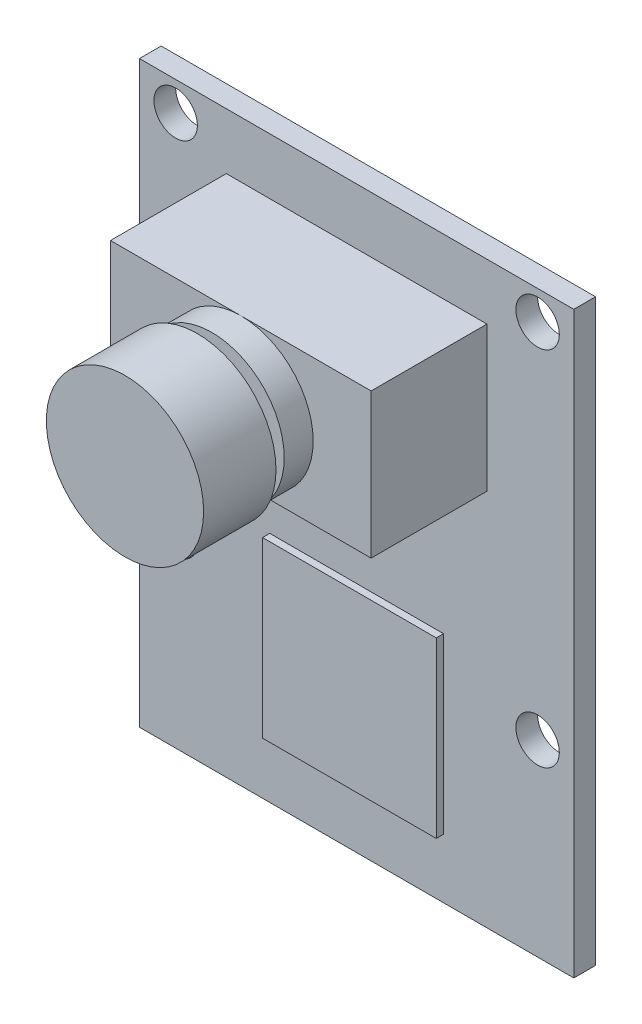
ISO-10303-21;
HEADER;
FILE_DESCRIPTION(('STEP AP214'),'2;1');
FILE_NAME('part.step','',(''),(''),'','','');
FILE_SCHEMA(('AUTOMOTIVE_DESIGN { 1 0 10303 214 1 1 1 1 }'));
ENDSEC;
DATA;
#1=APPLICATION_CONTEXT('core data for automotive mechanical design processes');
#2=APPLICATION_PROTOCOL_DEFINITION('international standard','automotive_design',2000,#1);
#3=PRODUCT_CONTEXT('',#1,'mechanical');
#4=PRODUCT('Part','Part','',(#3));
#5=PRODUCT_RELATED_PRODUCT_CATEGORY('part','',(#4));
#6=PRODUCT_DEFINITION_FORMATION('','',#4);
#7=PRODUCT_DEFINITION_CONTEXT('part definition',#1,'design');
#8=PRODUCT_DEFINITION('design','',#6,#7);
#9=PRODUCT_DEFINITION_SHAPE('','',#8);
#10=(LENGTH_UNIT() NAMED_UNIT(*) SI_UNIT(.MILLI.,.METRE.));
#11=(NAMED_UNIT(*) PLANE_ANGLE_UNIT() SI_UNIT($,.RADIAN.));
#12=(NAMED_UNIT(*) SI_UNIT($,.STERADIAN.) SOLID_ANGLE_UNIT());
#13=UNCERTAINTY_MEASURE_WITH_UNIT(LENGTH_MEASURE(1.E-05),#10,'distance_accuracy_value','');
#14=(GEOMETRIC_REPRESENTATION_CONTEXT(3) GLOBAL_UNCERTAINTY_ASSIGNED_CONTEXT((#13)) GLOBAL_UNIT_ASSIGNED_CONTEXT((#10,
#11,#12)) REPRESENTATION_CONTEXT('',''));
#15=CARTESIAN_POINT('',(0.,0.,0.));
#16=DIRECTION('',(0.,0.,1.));
#17=DIRECTION('',(1.,0.,0.));
#18=AXIS2_PLACEMENT_3D('',#15,#16,#17);
#19=CARTESIAN_POINT('',(0.,0.,1.5));
#20=DIRECTION('',(0.,0.,1.));
#21=DIRECTION('',(1.,0.,0.));
#22=AXIS2_PLACEMENT_3D('',#19,#20,#21);
#23=PLANE('',#22);
#24=CARTESIAN_POINT('',(12.5,-7.01054570839067,1.5));
#25=DIRECTION('',(0.,0.,1.));
#26=DIRECTION('',(1.,0.,0.));
#27=AXIS2_PLACEMENT_3D('',#24,#25,#26);
#28=CIRCLE('',#27,1.5);
#29=CARTESIAN_POINT('',(14.,-7.01054570839067,1.5));
#30=VERTEX_POINT('',#29);
#31=EDGE_CURVE('E235',#30,#30,#28,.T.);
#32=ORIENTED_EDGE('',*,*,#31,.F.);
#33=EDGE_LOOP('',(#32));
#34=FACE_BOUND('',#33,.T.);
#35=CARTESIAN_POINT('',(-12.5,-7.01054570839068,1.5));
#36=DIRECTION('',(0.,0.,1.));
#37=DIRECTION('',(1.,0.,0.));
#38=AXIS2_PLACEMENT_3D('',#35,#36,#37);
#39=CIRCLE('',#38,1.5);
#40=CARTESIAN_POINT('',(-11.,-7.01054570839068,1.5));
#41=VERTEX_POINT('',#40);
#42=EDGE_CURVE('E249',#41,#41,#39,.T.);
#43=ORIENTED_EDGE('',*,*,#42,.F.);
#44=EDGE_LOOP('',(#43));
#45=FACE_BOUND('',#44,.T.);
#46=CARTESIAN_POINT('',(-12.5,17.9894542916093,1.5));
#47=DIRECTION('',(0.,0.,1.));
#48=DIRECTION('',(1.,0.,0.));
#49=AXIS2_PLACEMENT_3D('',#46,#47,#48);
#50=CIRCLE('',#49,1.5);
#51=CARTESIAN_POINT('',(-11.,17.9894542916093,1.5));
#52=VERTEX_POINT('',#51);
#53=EDGE_CURVE('E241',#52,#52,#50,.T.);
#54=ORIENTED_EDGE('',*,*,#53,.F.);
#55=EDGE_LOOP('',(#54));
#56=FACE_BOUND('',#55,.T.);
#57=CARTESIAN_POINT('',(12.5,17.9894542916093,1.5));
#58=DIRECTION('',(0.,0.,1.));
#59=DIRECTION('',(1.,0.,0.));
#60=AXIS2_PLACEMENT_3D('',#57,#58,#59);
#61=CIRCLE('',#60,1.5);
#62=CARTESIAN_POINT('',(14.,17.9894542916093,1.5));
#63=VERTEX_POINT('',#62);
#64=EDGE_CURVE('E240',#63,#63,#61,.T.);
#65=ORIENTED_EDGE('',*,*,#64,.F.);
#66=EDGE_LOOP('',(#65));
#67=FACE_BOUND('',#66,.T.);
#68=DIRECTION('',(0.,-1.,0.));
#69=VECTOR('',#68,1.);
#70=CARTESIAN_POINT('',(-15.,-20.,1.5));
#71=LINE('',#70,#69);
#72=CARTESIAN_POINT('',(-15.,20.,1.5));
#73=VERTEX_POINT('',#72);
#74=CARTESIAN_POINT('',(-15.,-20.,1.5));
#75=VERTEX_POINT('',#74);
#76=EDGE_CURVE('E268',#73,#75,#71,.T.);
#77=ORIENTED_EDGE('',*,*,#76,.T.);
#78=DIRECTION('',(1.,0.,0.));
#79=VECTOR('',#78,1.);
#80=CARTESIAN_POINT('',(15.,-20.,1.5));
#81=LINE('',#80,#79);
#82=CARTESIAN_POINT('',(15.,-20.,1.5));
#83=VERTEX_POINT('',#82);
#84=EDGE_CURVE('E272',#75,#83,#81,.T.);
#85=ORIENTED_EDGE('',*,*,#84,.T.);
#86=DIRECTION('',(0.,1.,0.));
#87=VECTOR('',#86,1.);
#88=CARTESIAN_POINT('',(15.,-20.,1.5));
#89=LINE('',#88,#87);
#90=CARTESIAN_POINT('',(15.,20.,1.5));
#91=VERTEX_POINT('',#90);
#92=EDGE_CURVE('E276',#83,#91,#89,.T.);
#93=ORIENTED_EDGE('',*,*,#92,.T.);
#94=DIRECTION('',(-1.,0.,0.));
#95=VECTOR('',#94,1.);
#96=CARTESIAN_POINT('',(15.,20.,1.5));
#97=LINE('',#96,#95);
#98=EDGE_CURVE('E279',#91,#73,#97,.T.);
#99=ORIENTED_EDGE('',*,*,#98,.T.);
#100=EDGE_LOOP('',(#77,#85,#93,#99));
#101=FACE_BOUND('',#100,.T.);
#102=DIRECTION('',(1.,0.,0.));
#103=VECTOR('',#102,1.);
#104=CARTESIAN_POINT('',(9.,6.11683457044501,1.5));
#105=LINE('',#104,#103);
#106=CARTESIAN_POINT('',(-9.,6.116834570445,1.5));
#107=VERTEX_POINT('',#106);
#108=CARTESIAN_POINT('',(9.,6.11683457044501,1.5));
#109=VERTEX_POINT('',#108);
#110=EDGE_CURVE('E213',#107,#109,#105,.T.);
#111=ORIENTED_EDGE('',*,*,#110,.F.);
#112=DIRECTION('',(0.,-1.,0.));
#113=VECTOR('',#112,1.);
#114=CARTESIAN_POINT('',(-9.,6.116834570445,1.5));
#115=LINE('',#114,#113);
#116=CARTESIAN_POINT('',(-9.00000000000001,16.116834570445,1.5));
#117=VERTEX_POINT('',#116);
#118=EDGE_CURVE('E188',#117,#107,#115,.T.);
#119=ORIENTED_EDGE('',*,*,#118,.F.);
#120=DIRECTION('',(-1.,0.,0.));
#121=VECTOR('',#120,1.);
#122=CARTESIAN_POINT('',(9.,16.116834570445,1.5));
#123=LINE('',#122,#121);
#124=CARTESIAN_POINT('',(9.,16.116834570445,1.5));
#125=VERTEX_POINT('',#124);
#126=EDGE_CURVE('E197',#125,#117,#123,.T.);
#127=ORIENTED_EDGE('',*,*,#126,.F.);
#128=DIRECTION('',(0.,1.,0.));
#129=VECTOR('',#128,1.);
#130=CARTESIAN_POINT('',(9.,6.11683457044501,1.5));
#131=LINE('',#130,#129);
#132=EDGE_CURVE('E216',#109,#125,#131,.T.);
#133=ORIENTED_EDGE('',*,*,#132,.F.);
#134=EDGE_LOOP('',(#111,#119,#127,#133));
#135=FACE_BOUND('',#134,.T.);
#136=DIRECTION('',(1.,0.,0.));
#137=VECTOR('',#136,1.);
#138=CARTESIAN_POINT('',(6.,-15.903085882853,1.5));
#139=LINE('',#138,#137);
#140=CARTESIAN_POINT('',(-6.,-15.903085882853,1.5));
#141=VERTEX_POINT('',#140);
#142=CARTESIAN_POINT('',(6.,-15.903085882853,1.5));
#143=VERTEX_POINT('',#142);
#144=EDGE_CURVE('E346',#141,#143,#139,.T.);
#145=ORIENTED_EDGE('',*,*,#144,.F.);
#146=DIRECTION('',(0.,-1.,0.));
#147=VECTOR('',#146,1.);
#148=CARTESIAN_POINT('',(-6.,-15.903085882853,1.5));
#149=LINE('',#148,#147);
#150=CARTESIAN_POINT('',(-6.,-3.90308588285299,1.5));
#151=VERTEX_POINT('',#150);
#152=EDGE_CURVE('E163',#151,#141,#149,.T.);
#153=ORIENTED_EDGE('',*,*,#152,.F.);
#154=DIRECTION('',(-1.,0.,0.));
#155=VECTOR('',#154,1.);
#156=CARTESIAN_POINT('',(6.,-3.90308588285299,1.5));
#157=LINE('',#156,#155);
#158=CARTESIAN_POINT('',(6.,-3.90308588285299,1.5));
#159=VERTEX_POINT('',#158);
#160=EDGE_CURVE('E159',#159,#151,#157,.T.);
#161=ORIENTED_EDGE('',*,*,#160,.F.);
#162=DIRECTION('',(0.,1.,0.));
#163=VECTOR('',#162,1.);
#164=CARTESIAN_POINT('',(6.,-15.903085882853,1.5));
#165=LINE('',#164,#163);
#166=EDGE_CURVE('E348',#143,#159,#165,.T.);
#167=ORIENTED_EDGE('',*,*,#166,.F.);
#168=EDGE_LOOP('',(#145,#153,#161,#167));
#169=FACE_BOUND('',#168,.T.);
#170=ADVANCED_FACE('F41',(#34,#45,#56,#67,#101,#135,#169),#23,.T.);
#171=CARTESIAN_POINT('',(0.,0.,9.5));
#172=DIRECTION('',(0.,0.,1.));
#173=DIRECTION('',(1.,0.,0.));
#174=AXIS2_PLACEMENT_3D('',#171,#172,#173);
#175=PLANE('',#174);
#176=CARTESIAN_POINT('',(0.,11.116834570445,9.5));
#177=DIRECTION('',(0.,0.,1.));
#178=DIRECTION('',(1.,0.,0.));
#179=AXIS2_PLACEMENT_3D('',#176,#177,#178);
#180=CIRCLE('',#179,5.00000000000001);
#181=CARTESIAN_POINT('',(0.,16.116834570445,9.5));
#182=VERTEX_POINT('',#181);
#183=CARTESIAN_POINT('',(0.,6.116834570445,9.5));
#184=VERTEX_POINT('',#183);
#185=EDGE_CURVE('E182',#182,#184,#180,.T.);
#186=ORIENTED_EDGE('',*,*,#185,.F.);
#187=DIRECTION('',(-1.,0.,0.));
#188=VECTOR('',#187,1.);
#189=CARTESIAN_POINT('',(9.,16.116834570445,9.5));
#190=LINE('',#189,#188);
#191=CARTESIAN_POINT('',(-9.00000000000001,16.116834570445,9.5));
#192=VERTEX_POINT('',#191);
#193=EDGE_CURVE('E205',#182,#192,#190,.T.);
#194=ORIENTED_EDGE('',*,*,#193,.T.);
#195=DIRECTION('',(0.,-1.,0.));
#196=VECTOR('',#195,1.);
#197=CARTESIAN_POINT('',(-9.,6.116834570445,9.5));
#198=LINE('',#197,#196);
#199=CARTESIAN_POINT('',(-9.,6.116834570445,9.5));
#200=VERTEX_POINT('',#199);
#201=EDGE_CURVE('E192',#192,#200,#198,.T.);
#202=ORIENTED_EDGE('',*,*,#201,.T.);
#203=DIRECTION('',(1.,0.,0.));
#204=VECTOR('',#203,1.);
#205=CARTESIAN_POINT('',(9.,6.11683457044501,9.5));
#206=LINE('',#205,#204);
#207=EDGE_CURVE('E198',#200,#184,#206,.T.);
#208=ORIENTED_EDGE('',*,*,#207,.T.);
#209=EDGE_LOOP('',(#186,#194,#202,#208));
#210=FACE_BOUND('',#209,.T.);
#211=ADVANCED_FACE('F316',(#210),#175,.T.);
#212=CARTESIAN_POINT('',(-15.,-20.,1.5));
#213=DIRECTION('',(1.,0.,0.));
#214=DIRECTION('',(0.,0.,-1.));
#215=AXIS2_PLACEMENT_3D('',#212,#213,#214);
#216=PLANE('',#215);
#217=DIRECTION('',(0.,-1.,0.));
#218=VECTOR('',#217,1.);
#219=CARTESIAN_POINT('',(-15.,-20.,0.));
#220=LINE('',#219,#218);
#221=CARTESIAN_POINT('',(-15.,20.,0.));
#222=VERTEX_POINT('',#221);
#223=CARTESIAN_POINT('',(-15.,-20.,0.));
#224=VERTEX_POINT('',#223);
#225=EDGE_CURVE('E264',#222,#224,#220,.T.);
#226=ORIENTED_EDGE('',*,*,#225,.T.);
#227=DIRECTION('',(0.,0.,-1.));
#228=VECTOR('',#227,1.);
#229=CARTESIAN_POINT('',(-15.,-20.,1.5));
#230=LINE('',#229,#228);
#231=EDGE_CURVE('E45',#75,#224,#230,.T.);
#232=ORIENTED_EDGE('',*,*,#231,.F.);
#233=ORIENTED_EDGE('',*,*,#76,.F.);
#234=DIRECTION('',(0.,0.,-1.));
#235=VECTOR('',#234,1.);
#236=CARTESIAN_POINT('',(-15.,20.,1.5));
#237=LINE('',#236,#235);
#238=EDGE_CURVE('E282',#73,#222,#237,.T.);
#239=ORIENTED_EDGE('',*,*,#238,.T.);
#240=EDGE_LOOP('',(#226,#232,#233,#239));
#241=FACE_BOUND('',#240,.T.);
#242=ADVANCED_FACE('F43',(#241),#216,.F.);
#243=CARTESIAN_POINT('',(15.,-20.,1.5));
#244=DIRECTION('',(0.,1.,0.));
#245=DIRECTION('',(-1.,0.,0.));
#246=AXIS2_PLACEMENT_3D('',#243,#244,#245);
#247=PLANE('',#246);
#248=DIRECTION('',(1.,0.,0.));
#249=VECTOR('',#248,1.);
#250=CARTESIAN_POINT('',(15.,-20.,0.));
#251=LINE('',#250,#249);
#252=CARTESIAN_POINT('',(15.,-20.,0.));
#253=VERTEX_POINT('',#252);
#254=EDGE_CURVE('E286',#224,#253,#251,.T.);
#255=ORIENTED_EDGE('',*,*,#254,.T.);
#256=DIRECTION('',(0.,0.,-1.));
#257=VECTOR('',#256,1.);
#258=CARTESIAN_POINT('',(15.,-20.,1.5));
#259=LINE('',#258,#257);
#260=EDGE_CURVE('E300',#83,#253,#259,.T.);
#261=ORIENTED_EDGE('',*,*,#260,.F.);
#262=ORIENTED_EDGE('',*,*,#84,.F.);
#263=ORIENTED_EDGE('',*,*,#231,.T.);
#264=EDGE_LOOP('',(#255,#261,#262,#263));
#265=FACE_BOUND('',#264,.T.);
#266=ADVANCED_FACE('F440',(#265),#247,.F.);
#267=CARTESIAN_POINT('',(15.,-20.,1.5));
#268=DIRECTION('',(-1.,0.,0.));
#269=DIRECTION('',(0.,0.,1.));
#270=AXIS2_PLACEMENT_3D('',#267,#268,#269);
#271=PLANE('',#270);
#272=DIRECTION('',(0.,1.,0.));
#273=VECTOR('',#272,1.);
#274=CARTESIAN_POINT('',(15.,-20.,0.));
#275=LINE('',#274,#273);
#276=CARTESIAN_POINT('',(15.,20.,0.));
#277=VERTEX_POINT('',#276);
#278=EDGE_CURVE('E289',#253,#277,#275,.T.);
#279=ORIENTED_EDGE('',*,*,#278,.T.);
#280=DIRECTION('',(0.,0.,-1.));
#281=VECTOR('',#280,1.);
#282=CARTESIAN_POINT('',(15.,20.,1.5));
#283=LINE('',#282,#281);
#284=EDGE_CURVE('E297',#91,#277,#283,.T.);
#285=ORIENTED_EDGE('',*,*,#284,.F.);
#286=ORIENTED_EDGE('',*,*,#92,.F.);
#287=ORIENTED_EDGE('',*,*,#260,.T.);
#288=EDGE_LOOP('',(#279,#285,#286,#287));
#289=FACE_BOUND('',#288,.T.);
#290=ADVANCED_FACE('F437',(#289),#271,.F.);
#291=CARTESIAN_POINT('',(15.,20.,1.5));
#292=DIRECTION('',(0.,-1.,0.));
#293=DIRECTION('',(1.,0.,0.));
#294=AXIS2_PLACEMENT_3D('',#291,#292,#293);
#295=PLANE('',#294);
#296=DIRECTION('',(-1.,0.,0.));
#297=VECTOR('',#296,1.);
#298=CARTESIAN_POINT('',(15.,20.,0.));
#299=LINE('',#298,#297);
#300=EDGE_CURVE('E273',#277,#222,#299,.T.);
#301=ORIENTED_EDGE('',*,*,#300,.T.);
#302=ORIENTED_EDGE('',*,*,#238,.F.);
#303=ORIENTED_EDGE('',*,*,#98,.F.);
#304=ORIENTED_EDGE('',*,*,#284,.T.);
#305=EDGE_LOOP('',(#301,#302,#303,#304));
#306=FACE_BOUND('',#305,.T.);
#307=ADVANCED_FACE('F433',(#306),#295,.F.);
#308=CARTESIAN_POINT('',(0.,0.,0.));
#309=DIRECTION('',(0.,0.,1.));
#310=DIRECTION('',(1.,0.,0.));
#311=AXIS2_PLACEMENT_3D('',#308,#309,#310);
#312=PLANE('',#311);
#313=CARTESIAN_POINT('',(12.5,-7.01054570839067,0.));
#314=DIRECTION('',(0.,0.,1.));
#315=DIRECTION('',(1.,0.,0.));
#316=AXIS2_PLACEMENT_3D('',#313,#314,#315);
#317=CIRCLE('',#316,1.5);
#318=CARTESIAN_POINT('',(14.,-7.01054570839067,0.));
#319=VERTEX_POINT('',#318);
#320=EDGE_CURVE('E253',#319,#319,#317,.T.);
#321=ORIENTED_EDGE('',*,*,#320,.T.);
#322=EDGE_LOOP('',(#321));
#323=FACE_BOUND('',#322,.T.);
#324=CARTESIAN_POINT('',(-12.5,-7.01054570839068,0.));
#325=DIRECTION('',(0.,0.,1.));
#326=DIRECTION('',(1.,0.,0.));
#327=AXIS2_PLACEMENT_3D('',#324,#325,#326);
#328=CIRCLE('',#327,1.5);
#329=CARTESIAN_POINT('',(-11.,-7.01054570839068,0.));
#330=VERTEX_POINT('',#329);
#331=EDGE_CURVE('E245',#330,#330,#328,.T.);
#332=ORIENTED_EDGE('',*,*,#331,.T.);
#333=EDGE_LOOP('',(#332));
#334=FACE_BOUND('',#333,.T.);
#335=CARTESIAN_POINT('',(-12.5,17.9894542916093,0.));
#336=DIRECTION('',(0.,0.,1.));
#337=DIRECTION('',(1.,0.,0.));
#338=AXIS2_PLACEMENT_3D('',#335,#336,#337);
#339=CIRCLE('',#338,1.5);
#340=CARTESIAN_POINT('',(-11.,17.9894542916093,0.));
#341=VERTEX_POINT('',#340);
#342=EDGE_CURVE('E236',#341,#341,#339,.T.);
#343=ORIENTED_EDGE('',*,*,#342,.T.);
#344=EDGE_LOOP('',(#343));
#345=FACE_BOUND('',#344,.T.);
#346=CARTESIAN_POINT('',(12.5,17.9894542916093,0.));
#347=DIRECTION('',(0.,0.,1.));
#348=DIRECTION('',(1.,0.,0.));
#349=AXIS2_PLACEMENT_3D('',#346,#347,#348);
#350=CIRCLE('',#349,1.5);
#351=CARTESIAN_POINT('',(14.,17.9894542916093,0.));
#352=VERTEX_POINT('',#351);
#353=EDGE_CURVE('E260',#352,#352,#350,.T.);
#354=ORIENTED_EDGE('',*,*,#353,.T.);
#355=EDGE_LOOP('',(#354));
#356=FACE_BOUND('',#355,.T.);
#357=ORIENTED_EDGE('',*,*,#225,.F.);
#358=ORIENTED_EDGE('',*,*,#300,.F.);
#359=ORIENTED_EDGE('',*,*,#278,.F.);
#360=ORIENTED_EDGE('',*,*,#254,.F.);
#361=EDGE_LOOP('',(#357,#358,#359,#360));
#362=FACE_BOUND('',#361,.T.);
#363=ADVANCED_FACE('F428',(#323,#334,#345,#356,#362),#312,.F.);
#364=CARTESIAN_POINT('',(12.5,17.9894542916093,0.));
#365=DIRECTION('',(0.,0.,1.));
#366=DIRECTION('',(1.,0.,0.));
#367=AXIS2_PLACEMENT_3D('',#364,#365,#366);
#368=CYLINDRICAL_SURFACE('',#367,1.5);
#369=ORIENTED_EDGE('',*,*,#353,.F.);
#370=EDGE_LOOP('',(#369));
#371=FACE_BOUND('',#370,.T.);
#372=ORIENTED_EDGE('',*,*,#64,.T.);
#373=EDGE_LOOP('',(#372));
#374=FACE_BOUND('',#373,.T.);
#375=ADVANCED_FACE('F419',(#371,#374),#368,.F.);
#376=CARTESIAN_POINT('',(-12.5,17.9894542916093,0.));
#377=DIRECTION('',(0.,0.,1.));
#378=DIRECTION('',(1.,0.,0.));
#379=AXIS2_PLACEMENT_3D('',#376,#377,#378);
#380=CYLINDRICAL_SURFACE('',#379,1.5);
#381=ORIENTED_EDGE('',*,*,#342,.F.);
#382=EDGE_LOOP('',(#381));
#383=FACE_BOUND('',#382,.T.);
#384=ORIENTED_EDGE('',*,*,#53,.T.);
#385=EDGE_LOOP('',(#384));
#386=FACE_BOUND('',#385,.T.);
#387=ADVANCED_FACE('F415',(#383,#386),#380,.F.);
#388=CARTESIAN_POINT('',(-12.5,-7.01054570839068,0.));
#389=DIRECTION('',(0.,0.,1.));
#390=DIRECTION('',(1.,0.,0.));
#391=AXIS2_PLACEMENT_3D('',#388,#389,#390);
#392=CYLINDRICAL_SURFACE('',#391,1.5);
#393=ORIENTED_EDGE('',*,*,#331,.F.);
#394=EDGE_LOOP('',(#393));
#395=FACE_BOUND('',#394,.T.);
#396=ORIENTED_EDGE('',*,*,#42,.T.);
#397=EDGE_LOOP('',(#396));
#398=FACE_BOUND('',#397,.T.);
#399=ADVANCED_FACE('F418',(#395,#398),#392,.F.);
#400=CARTESIAN_POINT('',(12.5,-7.01054570839067,0.));
#401=DIRECTION('',(0.,0.,1.));
#402=DIRECTION('',(1.,0.,0.));
#403=AXIS2_PLACEMENT_3D('',#400,#401,#402);
#404=CYLINDRICAL_SURFACE('',#403,1.5);
#405=ORIENTED_EDGE('',*,*,#320,.F.);
#406=EDGE_LOOP('',(#405));
#407=FACE_BOUND('',#406,.T.);
#408=ORIENTED_EDGE('',*,*,#31,.T.);
#409=EDGE_LOOP('',(#408));
#410=FACE_BOUND('',#409,.T.);
#411=ADVANCED_FACE('F414',(#407,#410),#404,.F.);
#412=CARTESIAN_POINT('',(-9.,6.116834570445,9.5));
#413=DIRECTION('',(1.,0.,0.));
#414=DIRECTION('',(0.,1.,0.));
#415=AXIS2_PLACEMENT_3D('',#412,#413,#414);
#416=PLANE('',#415);
#417=ORIENTED_EDGE('',*,*,#118,.T.);
#418=DIRECTION('',(0.,0.,-1.));
#419=VECTOR('',#418,1.);
#420=CARTESIAN_POINT('',(-9.,6.116834570445,9.5));
#421=LINE('',#420,#419);
#422=EDGE_CURVE('E232',#200,#107,#421,.T.);
#423=ORIENTED_EDGE('',*,*,#422,.F.);
#424=ORIENTED_EDGE('',*,*,#201,.F.);
#425=DIRECTION('',(0.,0.,-1.));
#426=VECTOR('',#425,1.);
#427=CARTESIAN_POINT('',(-9.00000000000001,16.116834570445,9.5));
#428=LINE('',#427,#426);
#429=EDGE_CURVE('E209',#192,#117,#428,.T.);
#430=ORIENTED_EDGE('',*,*,#429,.T.);
#431=EDGE_LOOP('',(#417,#423,#424,#430));
#432=FACE_BOUND('',#431,.T.);
#433=ADVANCED_FACE('F338',(#432),#416,.F.);
#434=CARTESIAN_POINT('',(9.,6.11683457044501,9.5));
#435=DIRECTION('',(0.,1.,0.));
#436=DIRECTION('',(-1.,0.,0.));
#437=AXIS2_PLACEMENT_3D('',#434,#435,#436);
#438=PLANE('',#437);
#439=ORIENTED_EDGE('',*,*,#110,.T.);
#440=DIRECTION('',(0.,0.,-1.));
#441=VECTOR('',#440,1.);
#442=CARTESIAN_POINT('',(9.,6.11683457044501,9.5));
#443=LINE('',#442,#441);
#444=CARTESIAN_POINT('',(9.,6.11683457044501,9.5));
#445=VERTEX_POINT('',#444);
#446=EDGE_CURVE('E228',#445,#109,#443,.T.);
#447=ORIENTED_EDGE('',*,*,#446,.F.);
#448=EDGE_CURVE('E196',#184,#445,#206,.T.);
#449=ORIENTED_EDGE('',*,*,#448,.F.);
#450=ORIENTED_EDGE('',*,*,#207,.F.);
#451=ORIENTED_EDGE('',*,*,#422,.T.);
#452=EDGE_LOOP('',(#439,#447,#449,#450,#451));
#453=FACE_BOUND('',#452,.T.);
#454=ADVANCED_FACE('F322',(#453),#438,.F.);
#455=CARTESIAN_POINT('',(9.,6.11683457044501,9.5));
#456=DIRECTION('',(-1.,0.,0.));
#457=DIRECTION('',(0.,0.,1.));
#458=AXIS2_PLACEMENT_3D('',#455,#456,#457);
#459=PLANE('',#458);
#460=ORIENTED_EDGE('',*,*,#132,.T.);
#461=DIRECTION('',(0.,0.,-1.));
#462=VECTOR('',#461,1.);
#463=CARTESIAN_POINT('',(9.,16.116834570445,9.5));
#464=LINE('',#463,#462);
#465=CARTESIAN_POINT('',(9.,16.116834570445,9.5));
#466=VERTEX_POINT('',#465);
#467=EDGE_CURVE('E225',#466,#125,#464,.T.);
#468=ORIENTED_EDGE('',*,*,#467,.F.);
#469=DIRECTION('',(0.,1.,0.));
#470=VECTOR('',#469,1.);
#471=CARTESIAN_POINT('',(9.,6.11683457044501,9.5));
#472=LINE('',#471,#470);
#473=EDGE_CURVE('E202',#445,#466,#472,.T.);
#474=ORIENTED_EDGE('',*,*,#473,.F.);
#475=ORIENTED_EDGE('',*,*,#446,.T.);
#476=EDGE_LOOP('',(#460,#468,#474,#475));
#477=FACE_BOUND('',#476,.T.);
#478=ADVANCED_FACE('F331',(#477),#459,.F.);
#479=CARTESIAN_POINT('',(9.,16.116834570445,9.5));
#480=DIRECTION('',(0.,-1.,0.));
#481=DIRECTION('',(1.,0.,0.));
#482=AXIS2_PLACEMENT_3D('',#479,#480,#481);
#483=PLANE('',#482);
#484=ORIENTED_EDGE('',*,*,#126,.T.);
#485=ORIENTED_EDGE('',*,*,#429,.F.);
#486=ORIENTED_EDGE('',*,*,#193,.F.);
#487=EDGE_CURVE('E206',#466,#182,#190,.T.);
#488=ORIENTED_EDGE('',*,*,#487,.F.);
#489=ORIENTED_EDGE('',*,*,#467,.T.);
#490=EDGE_LOOP('',(#484,#485,#486,#488,#489));
#491=FACE_BOUND('',#490,.T.);
#492=ADVANCED_FACE('F335',(#491),#483,.F.);
#493=EDGE_CURVE('E51',#184,#182,#180,.T.);
#494=ORIENTED_EDGE('',*,*,#493,.F.);
#495=ORIENTED_EDGE('',*,*,#448,.T.);
#496=ORIENTED_EDGE('',*,*,#473,.T.);
#497=ORIENTED_EDGE('',*,*,#487,.T.);
#498=EDGE_LOOP('',(#494,#495,#496,#497));
#499=FACE_BOUND('',#498,.T.);
#500=ADVANCED_FACE('F327',(#499),#175,.T.);
#501=CARTESIAN_POINT('',(0.,11.116834570445,11.5));
#502=DIRECTION('',(0.,0.,-1.));
#503=DIRECTION('',(-1.,0.,0.));
#504=AXIS2_PLACEMENT_3D('',#501,#502,#503);
#505=CYLINDRICAL_SURFACE('',#504,5.00000000000001);
#506=CARTESIAN_POINT('',(0.,11.116834570445,11.5));
#507=DIRECTION('',(0.,0.,1.));
#508=DIRECTION('',(1.,0.,0.));
#509=AXIS2_PLACEMENT_3D('',#506,#507,#508);
#510=CIRCLE('',#509,5.00000000000001);
#511=CARTESIAN_POINT('',(5.,11.116834570445,11.5));
#512=VERTEX_POINT('',#511);
#513=EDGE_CURVE('E184',#512,#512,#510,.T.);
#514=ORIENTED_EDGE('',*,*,#513,.F.);
#515=EDGE_LOOP('',(#514));
#516=FACE_BOUND('',#515,.T.);
#517=ORIENTED_EDGE('',*,*,#185,.T.);
#518=ORIENTED_EDGE('',*,*,#493,.T.);
#519=EDGE_LOOP('',(#517,#518));
#520=FACE_BOUND('',#519,.T.);
#521=ADVANCED_FACE('F313',(#516,#520),#505,.T.);
#522=CARTESIAN_POINT('',(0.,11.116834570445,11.5));
#523=DIRECTION('',(0.,0.,1.));
#524=DIRECTION('',(1.,0.,0.));
#525=AXIS2_PLACEMENT_3D('',#522,#523,#524);
#526=PLANE('',#525);
#527=CARTESIAN_POINT('',(0.,11.116834570445,11.5));
#528=DIRECTION('',(0.,0.,1.));
#529=DIRECTION('',(1.,0.,0.));
#530=AXIS2_PLACEMENT_3D('',#527,#528,#529);
#531=CIRCLE('',#530,3.78256647952729);
#532=CARTESIAN_POINT('',(3.78256647952729,11.116834570445,11.5));
#533=VERTEX_POINT('',#532);
#534=EDGE_CURVE('E11',#533,#533,#531,.T.);
#535=ORIENTED_EDGE('',*,*,#534,.F.);
#536=EDGE_LOOP('',(#535));
#537=FACE_BOUND('',#536,.T.);
#538=ORIENTED_EDGE('',*,*,#513,.T.);
#539=EDGE_LOOP('',(#538));
#540=FACE_BOUND('',#539,.T.);
#541=ADVANCED_FACE('F396',(#537,#540),#526,.T.);
#542=CARTESIAN_POINT('',(0.,11.116834570445,12.5));
#543=DIRECTION('',(0.,0.,-1.));
#544=DIRECTION('',(-1.,0.,0.));
#545=AXIS2_PLACEMENT_3D('',#542,#543,#544);
#546=CYLINDRICAL_SURFACE('',#545,3.78256647952729);
#547=CARTESIAN_POINT('',(0.,11.116834570445,12.5));
#548=DIRECTION('',(0.,0.,1.));
#549=DIRECTION('',(1.,0.,0.));
#550=AXIS2_PLACEMENT_3D('',#547,#548,#549);
#551=CIRCLE('',#550,3.78256647952729);
#552=CARTESIAN_POINT('',(3.78256647952729,11.116834570445,12.5));
#553=VERTEX_POINT('',#552);
#554=EDGE_CURVE('E178',#553,#553,#551,.T.);
#555=ORIENTED_EDGE('',*,*,#554,.F.);
#556=EDGE_LOOP('',(#555));
#557=FACE_BOUND('',#556,.T.);
#558=ORIENTED_EDGE('',*,*,#534,.T.);
#559=EDGE_LOOP('',(#558));
#560=FACE_BOUND('',#559,.T.);
#561=ADVANCED_FACE('F392',(#557,#560),#546,.T.);
#562=CARTESIAN_POINT('',(0.,11.116834570445,17.5));
#563=DIRECTION('',(0.,0.,-1.));
#564=DIRECTION('',(-1.,0.,0.));
#565=AXIS2_PLACEMENT_3D('',#562,#563,#564);
#566=CYLINDRICAL_SURFACE('',#565,5.43156417161316);
#567=CARTESIAN_POINT('',(0.,11.116834570445,17.5));
#568=DIRECTION('',(0.,0.,1.));
#569=DIRECTION('',(1.,0.,0.));
#570=AXIS2_PLACEMENT_3D('',#567,#568,#569);
#571=CIRCLE('',#570,5.43156417161316);
#572=CARTESIAN_POINT('',(5.43156417161315,11.116834570445,17.5));
#573=VERTEX_POINT('',#572);
#574=EDGE_CURVE('E171',#573,#573,#571,.T.);
#575=ORIENTED_EDGE('',*,*,#574,.F.);
#576=EDGE_LOOP('',(#575));
#577=FACE_BOUND('',#576,.T.);
#578=CARTESIAN_POINT('',(0.,11.116834570445,12.5));
#579=DIRECTION('',(0.,0.,1.));
#580=DIRECTION('',(1.,0.,0.));
#581=AXIS2_PLACEMENT_3D('',#578,#579,#580);
#582=CIRCLE('',#581,5.43156417161316);
#583=CARTESIAN_POINT('',(5.43156417161315,11.116834570445,12.5));
#584=VERTEX_POINT('',#583);
#585=EDGE_CURVE('E166',#584,#584,#582,.T.);
#586=ORIENTED_EDGE('',*,*,#585,.T.);
#587=EDGE_LOOP('',(#586));
#588=FACE_BOUND('',#587,.T.);
#589=ADVANCED_FACE('F385',(#577,#588),#566,.T.);
#590=CARTESIAN_POINT('',(0.,11.116834570445,17.5));
#591=DIRECTION('',(0.,0.,1.));
#592=DIRECTION('',(1.,0.,0.));
#593=AXIS2_PLACEMENT_3D('',#590,#591,#592);
#594=PLANE('',#593);
#595=ORIENTED_EDGE('',*,*,#574,.T.);
#596=EDGE_LOOP('',(#595));
#597=FACE_BOUND('',#596,.T.);
#598=ADVANCED_FACE('F382',(#597),#594,.T.);
#599=CARTESIAN_POINT('',(0.,11.116834570445,12.5));
#600=DIRECTION('',(0.,0.,1.));
#601=DIRECTION('',(1.,0.,0.));
#602=AXIS2_PLACEMENT_3D('',#599,#600,#601);
#603=PLANE('',#602);
#604=ORIENTED_EDGE('',*,*,#554,.T.);
#605=EDGE_LOOP('',(#604));
#606=FACE_BOUND('',#605,.T.);
#607=ORIENTED_EDGE('',*,*,#585,.F.);
#608=EDGE_LOOP('',(#607));
#609=FACE_BOUND('',#608,.T.);
#610=ADVANCED_FACE('F381',(#606,#609),#603,.F.);
#611=CARTESIAN_POINT('',(-6.,-15.903085882853,2.));
#612=DIRECTION('',(1.,0.,0.));
#613=DIRECTION('',(0.,0.,-1.));
#614=AXIS2_PLACEMENT_3D('',#611,#612,#613);
#615=PLANE('',#614);
#616=ORIENTED_EDGE('',*,*,#152,.T.);
#617=DIRECTION('',(0.,0.,-1.));
#618=VECTOR('',#617,1.);
#619=CARTESIAN_POINT('',(-6.,-15.903085882853,2.));
#620=LINE('',#619,#618);
#621=CARTESIAN_POINT('',(-6.,-15.903085882853,2.));
#622=VERTEX_POINT('',#621);
#623=EDGE_CURVE('E142',#622,#141,#620,.T.);
#624=ORIENTED_EDGE('',*,*,#623,.F.);
#625=DIRECTION('',(0.,-1.,0.));
#626=VECTOR('',#625,1.);
#627=CARTESIAN_POINT('',(-6.,-15.903085882853,2.));
#628=LINE('',#627,#626);
#629=CARTESIAN_POINT('',(-6.,-3.90308588285299,2.));
#630=VERTEX_POINT('',#629);
#631=EDGE_CURVE('E150',#630,#622,#628,.T.);
#632=ORIENTED_EDGE('',*,*,#631,.F.);
#633=DIRECTION('',(0.,0.,-1.));
#634=VECTOR('',#633,1.);
#635=CARTESIAN_POINT('',(-6.,-3.90308588285299,2.));
#636=LINE('',#635,#634);
#637=EDGE_CURVE('E359',#630,#151,#636,.T.);
#638=ORIENTED_EDGE('',*,*,#637,.T.);
#639=EDGE_LOOP('',(#616,#624,#632,#638));
#640=FACE_BOUND('',#639,.T.);
#641=ADVANCED_FACE('F161',(#640),#615,.F.);
#642=CARTESIAN_POINT('',(6.,-15.903085882853,2.));
#643=DIRECTION('',(0.,1.,0.));
#644=DIRECTION('',(0.,0.,1.));
#645=AXIS2_PLACEMENT_3D('',#642,#643,#644);
#646=PLANE('',#645);
#647=ORIENTED_EDGE('',*,*,#144,.T.);
#648=DIRECTION('',(0.,0.,-1.));
#649=VECTOR('',#648,1.);
#650=CARTESIAN_POINT('',(6.,-15.903085882853,2.));
#651=LINE('',#650,#649);
#652=CARTESIAN_POINT('',(6.,-15.903085882853,2.));
#653=VERTEX_POINT('',#652);
#654=EDGE_CURVE('E145',#653,#143,#651,.T.);
#655=ORIENTED_EDGE('',*,*,#654,.F.);
#656=DIRECTION('',(1.,0.,0.));
#657=VECTOR('',#656,1.);
#658=CARTESIAN_POINT('',(6.,-15.903085882853,2.));
#659=LINE('',#658,#657);
#660=EDGE_CURVE('E138',#622,#653,#659,.T.);
#661=ORIENTED_EDGE('',*,*,#660,.F.);
#662=ORIENTED_EDGE('',*,*,#623,.T.);
#663=EDGE_LOOP('',(#647,#655,#661,#662));
#664=FACE_BOUND('',#663,.T.);
#665=ADVANCED_FACE('F140',(#664),#646,.F.);
#666=CARTESIAN_POINT('',(6.,-15.903085882853,2.));
#667=DIRECTION('',(-1.,0.,0.));
#668=DIRECTION('',(0.,0.,1.));
#669=AXIS2_PLACEMENT_3D('',#666,#667,#668);
#670=PLANE('',#669);
#671=ORIENTED_EDGE('',*,*,#166,.T.);
#672=DIRECTION('',(0.,0.,-1.));
#673=VECTOR('',#672,1.);
#674=CARTESIAN_POINT('',(6.,-3.90308588285299,2.));
#675=LINE('',#674,#673);
#676=CARTESIAN_POINT('',(6.,-3.90308588285299,2.));
#677=VERTEX_POINT('',#676);
#678=EDGE_CURVE('E59',#677,#159,#675,.T.);
#679=ORIENTED_EDGE('',*,*,#678,.F.);
#680=DIRECTION('',(0.,1.,0.));
#681=VECTOR('',#680,1.);
#682=CARTESIAN_POINT('',(6.,-15.903085882853,2.));
#683=LINE('',#682,#681);
#684=EDGE_CURVE('E149',#653,#677,#683,.T.);
#685=ORIENTED_EDGE('',*,*,#684,.F.);
#686=ORIENTED_EDGE('',*,*,#654,.T.);
#687=EDGE_LOOP('',(#671,#679,#685,#686));
#688=FACE_BOUND('',#687,.T.);
#689=ADVANCED_FACE('F366',(#688),#670,.F.);
#690=CARTESIAN_POINT('',(6.,-3.90308588285299,2.));
#691=DIRECTION('',(0.,-1.,0.));
#692=DIRECTION('',(1.,0.,0.));
#693=AXIS2_PLACEMENT_3D('',#690,#691,#692);
#694=PLANE('',#693);
#695=ORIENTED_EDGE('',*,*,#160,.T.);
#696=ORIENTED_EDGE('',*,*,#637,.F.);
#697=DIRECTION('',(-1.,0.,0.));
#698=VECTOR('',#697,1.);
#699=CARTESIAN_POINT('',(6.,-3.90308588285299,2.));
#700=LINE('',#699,#698);
#701=EDGE_CURVE('E154',#677,#630,#700,.T.);
#702=ORIENTED_EDGE('',*,*,#701,.F.);
#703=ORIENTED_EDGE('',*,*,#678,.T.);
#704=EDGE_LOOP('',(#695,#696,#702,#703));
#705=FACE_BOUND('',#704,.T.);
#706=ADVANCED_FACE('F367',(#705),#694,.F.);
#707=CARTESIAN_POINT('',(0.,0.,2.));
#708=DIRECTION('',(0.,0.,1.));
#709=DIRECTION('',(1.,0.,0.));
#710=AXIS2_PLACEMENT_3D('',#707,#708,#709);
#711=PLANE('',#710);
#712=ORIENTED_EDGE('',*,*,#631,.T.);
#713=ORIENTED_EDGE('',*,*,#660,.T.);
#714=ORIENTED_EDGE('',*,*,#684,.T.);
#715=ORIENTED_EDGE('',*,*,#701,.T.);
#716=EDGE_LOOP('',(#712,#713,#714,#715));
#717=FACE_BOUND('',#716,.T.);
#718=ADVANCED_FACE('F153',(#717),#711,.T.);
#719=CLOSED_SHELL('',(#170,#211,#242,#266,#290,#307,#363,#375,#387,#399,#411,#433,#454,#478,
#492,#500,#521,#541,#561,#589,#598,#610,#641,#665,#689,#706,#718));
#720=MANIFOLD_SOLID_BREP('B2',#719);
#721=ADVANCED_BREP_SHAPE_REPRESENTATION('',(#18,#720),#14);
#722=SHAPE_DEFINITION_REPRESENTATION(#9,#721);
ENDSEC;
END-ISO-10303-21;
